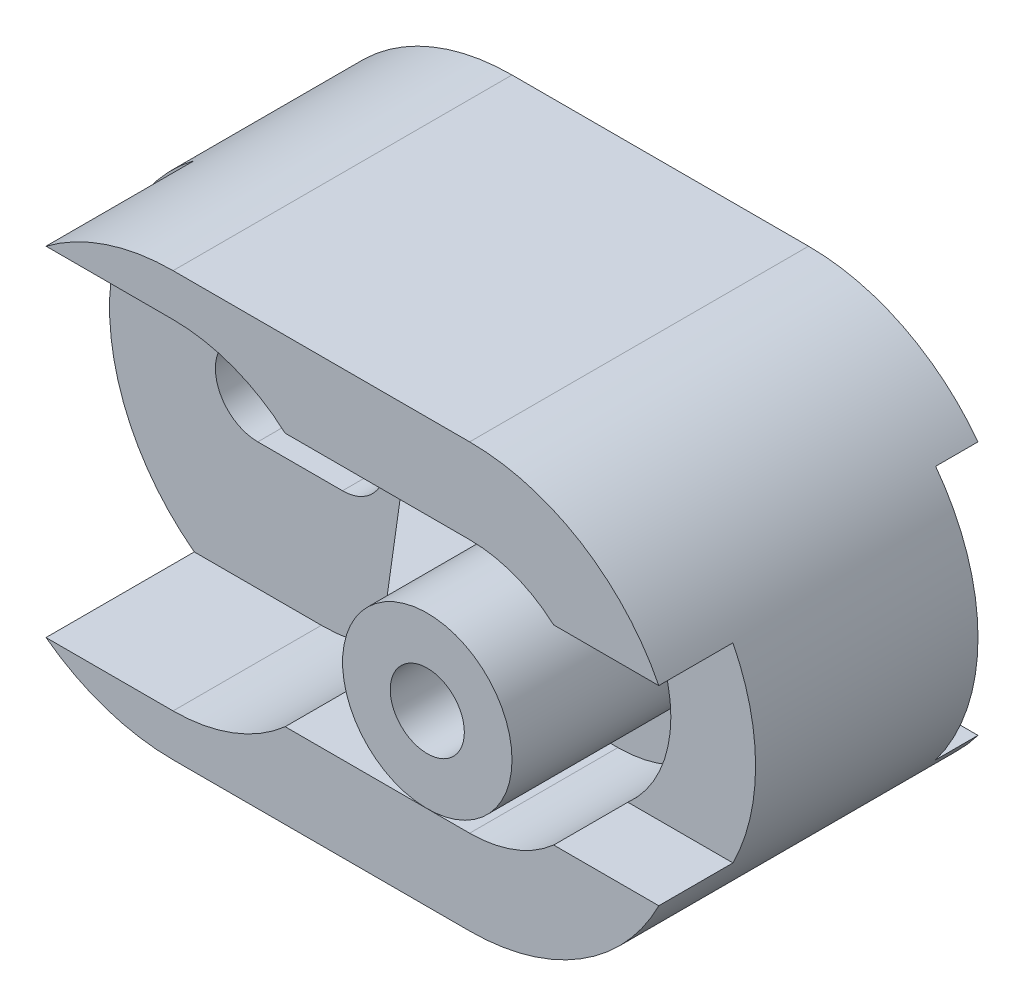
ISO-10303-21;
HEADER;
FILE_DESCRIPTION(('STEP AP214'),'2;1');
FILE_NAME('part.step','',(''),(''),'','','');
FILE_SCHEMA(('AUTOMOTIVE_DESIGN { 1 0 10303 214 1 1 1 1 }'));
ENDSEC;
DATA;
#1=APPLICATION_CONTEXT('core data for automotive mechanical design processes');
#2=APPLICATION_PROTOCOL_DEFINITION('international standard','automotive_design',2000,#1);
#3=PRODUCT_CONTEXT('',#1,'mechanical');
#4=PRODUCT('Part','Part','',(#3));
#5=PRODUCT_RELATED_PRODUCT_CATEGORY('part','',(#4));
#6=PRODUCT_DEFINITION_FORMATION('','',#4);
#7=PRODUCT_DEFINITION_CONTEXT('part definition',#1,'design');
#8=PRODUCT_DEFINITION('design','',#6,#7);
#9=PRODUCT_DEFINITION_SHAPE('','',#8);
#10=(LENGTH_UNIT() NAMED_UNIT(*) SI_UNIT(.MILLI.,.METRE.));
#11=(NAMED_UNIT(*) PLANE_ANGLE_UNIT() SI_UNIT($,.RADIAN.));
#12=(NAMED_UNIT(*) SI_UNIT($,.STERADIAN.) SOLID_ANGLE_UNIT());
#13=UNCERTAINTY_MEASURE_WITH_UNIT(LENGTH_MEASURE(1.E-05),#10,'distance_accuracy_value','');
#14=(GEOMETRIC_REPRESENTATION_CONTEXT(3) GLOBAL_UNCERTAINTY_ASSIGNED_CONTEXT((#13)) GLOBAL_UNIT_ASSIGNED_CONTEXT((#10,
#11,#12)) REPRESENTATION_CONTEXT('',''));
#15=CARTESIAN_POINT('',(0.,0.,0.));
#16=DIRECTION('',(0.,0.,1.));
#17=DIRECTION('',(1.,0.,0.));
#18=AXIS2_PLACEMENT_3D('',#15,#16,#17);
#19=CARTESIAN_POINT('',(1.5,0.5,4.5));
#20=DIRECTION('',(-1.,0.,0.));
#21=DIRECTION('',(0.,0.,1.));
#22=AXIS2_PLACEMENT_3D('',#19,#20,#21);
#23=PLANE('',#22);
#24=DIRECTION('',(0.,0.,-1.));
#25=VECTOR('',#24,1.);
#26=CARTESIAN_POINT('',(1.5,-0.5,4.5));
#27=LINE('',#26,#25);
#28=CARTESIAN_POINT('',(1.5,-0.5,8.));
#29=VERTEX_POINT('',#28);
#30=CARTESIAN_POINT('',(1.5,-0.5,4.5));
#31=VERTEX_POINT('',#30);
#32=EDGE_CURVE('E96',#29,#31,#27,.T.);
#33=ORIENTED_EDGE('',*,*,#32,.T.);
#34=DIRECTION('',(0.,-1.,0.));
#35=VECTOR('',#34,1.);
#36=CARTESIAN_POINT('',(1.5,0.5,4.5));
#37=LINE('',#36,#35);
#38=CARTESIAN_POINT('',(1.5,0.5,4.5));
#39=VERTEX_POINT('',#38);
#40=EDGE_CURVE('E12',#39,#31,#37,.T.);
#41=ORIENTED_EDGE('',*,*,#40,.F.);
#42=DIRECTION('',(0.,0.,-1.));
#43=VECTOR('',#42,1.);
#44=CARTESIAN_POINT('',(1.5,0.5,4.5));
#45=LINE('',#44,#43);
#46=CARTESIAN_POINT('',(1.5,0.5,8.));
#47=VERTEX_POINT('',#46);
#48=EDGE_CURVE('E89',#47,#39,#45,.T.);
#49=ORIENTED_EDGE('',*,*,#48,.F.);
#50=DIRECTION('',(0.,-1.,0.));
#51=VECTOR('',#50,1.);
#52=CARTESIAN_POINT('',(1.5,0.5,8.));
#53=LINE('',#52,#51);
#54=CARTESIAN_POINT('',(1.5,0.,8.));
#55=VERTEX_POINT('',#54);
#56=EDGE_CURVE('E105',#47,#55,#53,.T.);
#57=ORIENTED_EDGE('',*,*,#56,.T.);
#58=EDGE_CURVE('E60',#55,#29,#53,.T.);
#59=ORIENTED_EDGE('',*,*,#58,.T.);
#60=EDGE_LOOP('',(#33,#41,#49,#57,#59));
#61=FACE_BOUND('',#60,.T.);
#62=ADVANCED_FACE('F46',(#61),#23,.F.);
#63=CARTESIAN_POINT('',(-1.5,0.5,4.5));
#64=DIRECTION('',(0.,0.,1.));
#65=DIRECTION('',(1.,0.,0.));
#66=AXIS2_PLACEMENT_3D('',#63,#64,#65);
#67=PLANE('',#66);
#68=DIRECTION('',(-1.,0.,0.));
#69=VECTOR('',#68,1.);
#70=CARTESIAN_POINT('',(-1.5,-0.5,4.5));
#71=LINE('',#70,#69);
#72=CARTESIAN_POINT('',(-1.5,-0.5,4.5));
#73=VERTEX_POINT('',#72);
#74=EDGE_CURVE('E99',#31,#73,#71,.T.);
#75=ORIENTED_EDGE('',*,*,#74,.T.);
#76=DIRECTION('',(0.,-1.,0.));
#77=VECTOR('',#76,1.);
#78=CARTESIAN_POINT('',(-1.5,0.5,4.5));
#79=LINE('',#78,#77);
#80=CARTESIAN_POINT('',(-1.5,0.5,4.5));
#81=VERTEX_POINT('',#80);
#82=EDGE_CURVE('E53',#81,#73,#79,.T.);
#83=ORIENTED_EDGE('',*,*,#82,.F.);
#84=DIRECTION('',(-1.,0.,0.));
#85=VECTOR('',#84,1.);
#86=CARTESIAN_POINT('',(-1.5,0.5,4.5));
#87=LINE('',#86,#85);
#88=EDGE_CURVE('E85',#39,#81,#87,.T.);
#89=ORIENTED_EDGE('',*,*,#88,.F.);
#90=ORIENTED_EDGE('',*,*,#40,.T.);
#91=EDGE_LOOP('',(#75,#83,#89,#90));
#92=FACE_BOUND('',#91,.T.);
#93=ADVANCED_FACE('F86',(#92),#67,.F.);
#94=CARTESIAN_POINT('',(1.5,0.5,8.));
#95=DIRECTION('',(0.759256602365297,0.,-0.650791373455969));
#96=DIRECTION('',(-0.650791373455969,0.,-0.759256602365297));
#97=AXIS2_PLACEMENT_3D('',#94,#95,#96);
#98=PLANE('',#97);
#99=DIRECTION('',(0.650791373455969,0.,0.759256602365297));
#100=VECTOR('',#99,1.);
#101=CARTESIAN_POINT('',(1.5,-0.5,8.));
#102=LINE('',#101,#100);
#103=EDGE_CURVE('E93',#73,#29,#102,.T.);
#104=ORIENTED_EDGE('',*,*,#103,.T.);
#105=ORIENTED_EDGE('',*,*,#58,.F.);
#106=ORIENTED_EDGE('',*,*,#56,.F.);
#107=DIRECTION('',(0.650791373455969,0.,0.759256602365297));
#108=VECTOR('',#107,1.);
#109=CARTESIAN_POINT('',(1.5,0.5,8.));
#110=LINE('',#109,#108);
#111=EDGE_CURVE('E69',#81,#47,#110,.T.);
#112=ORIENTED_EDGE('',*,*,#111,.F.);
#113=ORIENTED_EDGE('',*,*,#82,.T.);
#114=EDGE_LOOP('',(#104,#105,#106,#112,#113));
#115=FACE_BOUND('',#114,.T.);
#116=ADVANCED_FACE('F106',(#115),#98,.F.);
#117=CARTESIAN_POINT('',(0.,0.5,0.));
#118=DIRECTION('',(0.,1.,0.));
#119=DIRECTION('',(0.,0.,1.));
#120=AXIS2_PLACEMENT_3D('',#117,#118,#119);
#121=PLANE('',#120);
#122=ORIENTED_EDGE('',*,*,#48,.T.);
#123=ORIENTED_EDGE('',*,*,#88,.T.);
#124=ORIENTED_EDGE('',*,*,#111,.T.);
#125=EDGE_LOOP('',(#122,#123,#124));
#126=FACE_BOUND('',#125,.T.);
#127=ADVANCED_FACE('F92',(#126),#121,.T.);
#128=CARTESIAN_POINT('',(0.,-0.5,0.));
#129=DIRECTION('',(0.,1.,0.));
#130=DIRECTION('',(0.,0.,1.));
#131=AXIS2_PLACEMENT_3D('',#128,#129,#130);
#132=PLANE('',#131);
#133=ORIENTED_EDGE('',*,*,#32,.F.);
#134=ORIENTED_EDGE('',*,*,#103,.F.);
#135=ORIENTED_EDGE('',*,*,#74,.F.);
#136=EDGE_LOOP('',(#133,#134,#135));
#137=FACE_BOUND('',#136,.T.);
#138=ADVANCED_FACE('F107',(#137),#132,.F.);
#139=CLOSED_SHELL('',(#62,#93,#116,#127,#138));
#140=MANIFOLD_SOLID_BREP('B2',#139);
#141=CARTESIAN_POINT('',(3.5,0.,8.));
#142=DIRECTION('',(0.,0.,-1.));
#143=DIRECTION('',(-1.,0.,0.));
#144=AXIS2_PLACEMENT_3D('',#141,#142,#143);
#145=CYLINDRICAL_SURFACE('',#144,5.);
#146=DIRECTION('',(0.,0.,1.));
#147=VECTOR('',#146,1.);
#148=CARTESIAN_POINT('',(7.96514277487294,2.25,6.25));
#149=LINE('',#148,#147);
#150=CARTESIAN_POINT('',(7.96514277487294,2.25,6.25));
#151=VERTEX_POINT('',#150);
#152=CARTESIAN_POINT('',(7.96514277487294,2.25,8.));
#153=VERTEX_POINT('',#152);
#154=EDGE_CURVE('E367',#151,#153,#149,.T.);
#155=ORIENTED_EDGE('',*,*,#154,.F.);
#156=CARTESIAN_POINT('',(3.5,0.,6.25));
#157=DIRECTION('',(0.,0.,1.));
#158=DIRECTION('',(1.,0.,0.));
#159=AXIS2_PLACEMENT_3D('',#156,#157,#158);
#160=CIRCLE('',#159,5.);
#161=CARTESIAN_POINT('',(7.96514277487294,-2.25,6.25));
#162=VERTEX_POINT('',#161);
#163=EDGE_CURVE('E357',#162,#151,#160,.T.);
#164=ORIENTED_EDGE('',*,*,#163,.F.);
#165=DIRECTION('',(0.,0.,1.));
#166=VECTOR('',#165,1.);
#167=CARTESIAN_POINT('',(7.96514277487294,-2.25,6.25));
#168=LINE('',#167,#166);
#169=CARTESIAN_POINT('',(7.96514277487294,-2.25,8.));
#170=VERTEX_POINT('',#169);
#171=EDGE_CURVE('E369',#162,#170,#168,.T.);
#172=ORIENTED_EDGE('',*,*,#171,.T.);
#173=CARTESIAN_POINT('',(3.5,0.,8.));
#174=DIRECTION('',(0.,0.,1.));
#175=DIRECTION('',(1.,0.,0.));
#176=AXIS2_PLACEMENT_3D('',#173,#174,#175);
#177=CIRCLE('',#176,5.);
#178=CARTESIAN_POINT('',(3.5,-5.,8.));
#179=VERTEX_POINT('',#178);
#180=EDGE_CURVE('E497',#179,#170,#177,.T.);
#181=ORIENTED_EDGE('',*,*,#180,.F.);
#182=DIRECTION('',(0.,0.,-1.));
#183=VECTOR('',#182,1.);
#184=CARTESIAN_POINT('',(3.5,-5.,8.));
#185=LINE('',#184,#183);
#186=CARTESIAN_POINT('',(3.5,-5.,0.));
#187=VERTEX_POINT('',#186);
#188=EDGE_CURVE('E519',#179,#187,#185,.T.);
#189=ORIENTED_EDGE('',*,*,#188,.T.);
#190=CARTESIAN_POINT('',(3.5,0.,0.));
#191=DIRECTION('',(0.,0.,1.));
#192=DIRECTION('',(1.,0.,0.));
#193=AXIS2_PLACEMENT_3D('',#190,#191,#192);
#194=CIRCLE('',#193,5.);
#195=CARTESIAN_POINT('',(7.5,-3.,0.));
#196=VERTEX_POINT('',#195);
#197=EDGE_CURVE('E509',#187,#196,#194,.T.);
#198=ORIENTED_EDGE('',*,*,#197,.T.);
#199=DIRECTION('',(0.,0.,-1.));
#200=VECTOR('',#199,1.);
#201=CARTESIAN_POINT('',(7.5,-3.,8.));
#202=LINE('',#201,#200);
#203=CARTESIAN_POINT('',(7.5,-3.,1.));
#204=VERTEX_POINT('',#203);
#205=EDGE_CURVE('E479',#196,#204,#202,.F.);
#206=ORIENTED_EDGE('',*,*,#205,.T.);
#207=CARTESIAN_POINT('',(3.5,0.,1.));
#208=DIRECTION('',(0.,0.,1.));
#209=DIRECTION('',(0.,-1.,0.));
#210=AXIS2_PLACEMENT_3D('',#207,#208,#209);
#211=CIRCLE('',#210,5.);
#212=CARTESIAN_POINT('',(7.50000000000001,3.,1.));
#213=VERTEX_POINT('',#212);
#214=EDGE_CURVE('E531',#204,#213,#211,.T.);
#215=ORIENTED_EDGE('',*,*,#214,.T.);
#216=DIRECTION('',(0.,0.,-1.));
#217=VECTOR('',#216,1.);
#218=CARTESIAN_POINT('',(7.50000000000001,3.,8.));
#219=LINE('',#218,#217);
#220=CARTESIAN_POINT('',(7.5,3.,0.));
#221=VERTEX_POINT('',#220);
#222=EDGE_CURVE('E471',#213,#221,#219,.T.);
#223=ORIENTED_EDGE('',*,*,#222,.T.);
#224=CARTESIAN_POINT('',(3.5,5.,0.));
#225=VERTEX_POINT('',#224);
#226=EDGE_CURVE('E508',#221,#225,#194,.T.);
#227=ORIENTED_EDGE('',*,*,#226,.T.);
#228=DIRECTION('',(0.,0.,-1.));
#229=VECTOR('',#228,1.);
#230=CARTESIAN_POINT('',(3.5,5.,8.));
#231=LINE('',#230,#229);
#232=CARTESIAN_POINT('',(3.5,5.,8.));
#233=VERTEX_POINT('',#232);
#234=EDGE_CURVE('E516',#233,#225,#231,.T.);
#235=ORIENTED_EDGE('',*,*,#234,.F.);
#236=EDGE_CURVE('E496',#153,#233,#177,.T.);
#237=ORIENTED_EDGE('',*,*,#236,.F.);
#238=EDGE_LOOP('',(#155,#164,#172,#181,#189,#198,#206,#215,#223,#227,#235,#237));
#239=FACE_BOUND('',#238,.T.);
#240=ADVANCED_FACE('F145',(#239),#145,.T.);
#241=CARTESIAN_POINT('',(-3.5,0.,8.));
#242=DIRECTION('',(0.,0.,1.));
#243=DIRECTION('',(1.,0.,0.));
#244=AXIS2_PLACEMENT_3D('',#241,#242,#243);
#245=PLANE('',#244);
#246=CARTESIAN_POINT('',(3.5,0.,8.));
#247=DIRECTION('',(0.,0.,1.));
#248=DIRECTION('',(1.,0.,0.));
#249=AXIS2_PLACEMENT_3D('',#246,#247,#248);
#250=CIRCLE('',#249,3.);
#251=CARTESIAN_POINT('',(5.48431348329844,2.25,8.));
#252=VERTEX_POINT('',#251);
#253=CARTESIAN_POINT('',(3.5,3.,8.));
#254=VERTEX_POINT('',#253);
#255=EDGE_CURVE('E417',#252,#254,#250,.T.);
#256=ORIENTED_EDGE('',*,*,#255,.F.);
#257=DIRECTION('',(1.,0.,0.));
#258=VECTOR('',#257,1.);
#259=CARTESIAN_POINT('',(0.,2.25,8.));
#260=LINE('',#259,#258);
#261=EDGE_CURVE('E354',#252,#153,#260,.T.);
#262=ORIENTED_EDGE('',*,*,#261,.T.);
#263=ORIENTED_EDGE('',*,*,#236,.T.);
#264=DIRECTION('',(-1.,0.,0.));
#265=VECTOR('',#264,1.);
#266=CARTESIAN_POINT('',(-3.5,5.,8.));
#267=LINE('',#266,#265);
#268=CARTESIAN_POINT('',(-3.5,5.,8.));
#269=VERTEX_POINT('',#268);
#270=EDGE_CURVE('E500',#233,#269,#267,.T.);
#271=ORIENTED_EDGE('',*,*,#270,.T.);
#272=CARTESIAN_POINT('',(-3.5,0.,8.));
#273=DIRECTION('',(0.,0.,1.));
#274=DIRECTION('',(1.,0.,0.));
#275=AXIS2_PLACEMENT_3D('',#272,#273,#274);
#276=CIRCLE('',#275,5.);
#277=CARTESIAN_POINT('',(-6.5,4.,8.));
#278=VERTEX_POINT('',#277);
#279=EDGE_CURVE('E490',#269,#278,#276,.T.);
#280=ORIENTED_EDGE('',*,*,#279,.T.);
#281=DIRECTION('',(1.,0.,0.));
#282=VECTOR('',#281,1.);
#283=CARTESIAN_POINT('',(-3.5,4.,8.));
#284=LINE('',#283,#282);
#285=CARTESIAN_POINT('',(-3.5,4.,8.));
#286=VERTEX_POINT('',#285);
#287=EDGE_CURVE('E539',#278,#286,#284,.T.);
#288=ORIENTED_EDGE('',*,*,#287,.T.);
#289=CARTESIAN_POINT('',(-3.5,0.,8.));
#290=DIRECTION('',(0.,0.,1.));
#291=DIRECTION('',(1.,0.,0.));
#292=AXIS2_PLACEMENT_3D('',#289,#290,#291);
#293=CIRCLE('',#292,4.);
#294=CARTESIAN_POINT('',(-0.85424868893541,3.,8.));
#295=VERTEX_POINT('',#294);
#296=EDGE_CURVE('E396',#295,#286,#293,.T.);
#297=ORIENTED_EDGE('',*,*,#296,.F.);
#298=DIRECTION('',(1.,0.,0.));
#299=VECTOR('',#298,1.);
#300=CARTESIAN_POINT('',(0.,3.,8.));
#301=LINE('',#300,#299);
#302=EDGE_CURVE('E421',#295,#254,#301,.T.);
#303=ORIENTED_EDGE('',*,*,#302,.T.);
#304=EDGE_LOOP('',(#256,#262,#263,#271,#280,#288,#297,#303));
#305=FACE_BOUND('',#304,.T.);
#306=ADVANCED_FACE('F606',(#305),#245,.T.);
#307=CARTESIAN_POINT('',(3.5,0.,4.5));
#308=DIRECTION('',(0.,0.,1.));
#309=DIRECTION('',(1.,0.,0.));
#310=AXIS2_PLACEMENT_3D('',#307,#308,#309);
#311=CYLINDRICAL_SURFACE('',#310,3.);
#312=DIRECTION('',(0.,0.,1.));
#313=VECTOR('',#312,1.);
#314=CARTESIAN_POINT('',(5.48431348329844,2.25,6.25));
#315=LINE('',#314,#313);
#316=CARTESIAN_POINT('',(5.48431348329844,2.25,6.25));
#317=VERTEX_POINT('',#316);
#318=EDGE_CURVE('E364',#317,#252,#315,.T.);
#319=ORIENTED_EDGE('',*,*,#318,.T.);
#320=ORIENTED_EDGE('',*,*,#255,.T.);
#321=DIRECTION('',(0.,0.,1.));
#322=VECTOR('',#321,1.);
#323=CARTESIAN_POINT('',(3.5,3.,4.5));
#324=LINE('',#323,#322);
#325=CARTESIAN_POINT('',(3.5,3.,4.5));
#326=VERTEX_POINT('',#325);
#327=EDGE_CURVE('E432',#326,#254,#324,.T.);
#328=ORIENTED_EDGE('',*,*,#327,.F.);
#329=CARTESIAN_POINT('',(3.5,0.,4.5));
#330=DIRECTION('',(0.,0.,1.));
#331=DIRECTION('',(1.,0.,0.));
#332=AXIS2_PLACEMENT_3D('',#329,#330,#331);
#333=CIRCLE('',#332,3.);
#334=CARTESIAN_POINT('',(3.5,-3.,4.5));
#335=VERTEX_POINT('',#334);
#336=EDGE_CURVE('E400',#335,#326,#333,.T.);
#337=ORIENTED_EDGE('',*,*,#336,.F.);
#338=DIRECTION('',(0.,0.,1.));
#339=VECTOR('',#338,1.);
#340=CARTESIAN_POINT('',(3.5,-3.,4.5));
#341=LINE('',#340,#339);
#342=CARTESIAN_POINT('',(3.5,-3.,8.));
#343=VERTEX_POINT('',#342);
#344=EDGE_CURVE('E435',#335,#343,#341,.T.);
#345=ORIENTED_EDGE('',*,*,#344,.T.);
#346=CARTESIAN_POINT('',(5.48431348329845,-2.25,8.));
#347=VERTEX_POINT('',#346);
#348=EDGE_CURVE('E418',#343,#347,#250,.T.);
#349=ORIENTED_EDGE('',*,*,#348,.T.);
#350=DIRECTION('',(0.,0.,1.));
#351=VECTOR('',#350,1.);
#352=CARTESIAN_POINT('',(5.48431348329845,-2.25,6.25));
#353=LINE('',#352,#351);
#354=CARTESIAN_POINT('',(5.48431348329845,-2.25,6.25));
#355=VERTEX_POINT('',#354);
#356=EDGE_CURVE('E360',#355,#347,#353,.T.);
#357=ORIENTED_EDGE('',*,*,#356,.F.);
#358=CARTESIAN_POINT('',(3.5,0.,6.25));
#359=DIRECTION('',(0.,0.,1.));
#360=DIRECTION('',(1.,0.,0.));
#361=AXIS2_PLACEMENT_3D('',#358,#359,#360);
#362=CIRCLE('',#361,3.);
#363=EDGE_CURVE('E351',#317,#355,#362,.F.);
#364=ORIENTED_EDGE('',*,*,#363,.F.);
#365=EDGE_LOOP('',(#319,#320,#328,#337,#345,#349,#357,#364));
#366=FACE_BOUND('',#365,.T.);
#367=ADVANCED_FACE('F658',(#366),#311,.F.);
#368=CARTESIAN_POINT('',(-3.5,0.,0.));
#369=DIRECTION('',(0.,0.,1.));
#370=DIRECTION('',(1.,0.,0.));
#371=AXIS2_PLACEMENT_3D('',#368,#369,#370);
#372=PLANE('',#371);
#373=CARTESIAN_POINT('',(-3.5,0.,0.));
#374=DIRECTION('',(0.,0.,1.));
#375=DIRECTION('',(1.,0.,0.));
#376=AXIS2_PLACEMENT_3D('',#373,#374,#375);
#377=CIRCLE('',#376,5.);
#378=CARTESIAN_POINT('',(-7.5,-3.,0.));
#379=VERTEX_POINT('',#378);
#380=CARTESIAN_POINT('',(-3.5,-5.,0.));
#381=VERTEX_POINT('',#380);
#382=EDGE_CURVE('E489',#379,#381,#377,.T.);
#383=ORIENTED_EDGE('',*,*,#382,.F.);
#384=DIRECTION('',(1.,0.,0.));
#385=VECTOR('',#384,1.);
#386=CARTESIAN_POINT('',(-3.5,-3.,0.));
#387=LINE('',#386,#385);
#388=EDGE_CURVE('E528',#379,#196,#387,.T.);
#389=ORIENTED_EDGE('',*,*,#388,.T.);
#390=ORIENTED_EDGE('',*,*,#197,.F.);
#391=DIRECTION('',(1.,0.,0.));
#392=VECTOR('',#391,1.);
#393=CARTESIAN_POINT('',(-3.5,-5.,0.));
#394=LINE('',#393,#392);
#395=EDGE_CURVE('E506',#381,#187,#394,.T.);
#396=ORIENTED_EDGE('',*,*,#395,.F.);
#397=EDGE_LOOP('',(#383,#389,#390,#396));
#398=FACE_BOUND('',#397,.T.);
#399=ADVANCED_FACE('F632',(#398),#372,.F.);
#400=CARTESIAN_POINT('',(-3.5,0.,8.));
#401=DIRECTION('',(0.,0.,-1.));
#402=DIRECTION('',(-1.,0.,0.));
#403=AXIS2_PLACEMENT_3D('',#400,#401,#402);
#404=CYLINDRICAL_SURFACE('',#403,5.);
#405=CARTESIAN_POINT('',(-6.5,-4.,8.));
#406=VERTEX_POINT('',#405);
#407=CARTESIAN_POINT('',(-3.5,-5.,8.));
#408=VERTEX_POINT('',#407);
#409=EDGE_CURVE('E494',#406,#408,#276,.T.);
#410=ORIENTED_EDGE('',*,*,#409,.F.);
#411=DIRECTION('',(0.,0.,-1.));
#412=VECTOR('',#411,1.);
#413=CARTESIAN_POINT('',(-6.5,-4.,8.));
#414=LINE('',#413,#412);
#415=CARTESIAN_POINT('',(-6.5,-4.,4.5));
#416=VERTEX_POINT('',#415);
#417=EDGE_CURVE('E440',#406,#416,#414,.T.);
#418=ORIENTED_EDGE('',*,*,#417,.T.);
#419=CARTESIAN_POINT('',(-3.5,0.,4.5));
#420=DIRECTION('',(0.,0.,1.));
#421=DIRECTION('',(1.,0.,0.));
#422=AXIS2_PLACEMENT_3D('',#419,#420,#421);
#423=CIRCLE('',#422,5.);
#424=CARTESIAN_POINT('',(-6.5,4.,4.5));
#425=VERTEX_POINT('',#424);
#426=EDGE_CURVE('E544',#425,#416,#423,.T.);
#427=ORIENTED_EDGE('',*,*,#426,.F.);
#428=DIRECTION('',(0.,0.,-1.));
#429=VECTOR('',#428,1.);
#430=CARTESIAN_POINT('',(-6.5,4.,8.));
#431=LINE('',#430,#429);
#432=EDGE_CURVE('E427',#278,#425,#431,.T.);
#433=ORIENTED_EDGE('',*,*,#432,.F.);
#434=ORIENTED_EDGE('',*,*,#279,.F.);
#435=DIRECTION('',(0.,0.,-1.));
#436=VECTOR('',#435,1.);
#437=CARTESIAN_POINT('',(-3.5,5.,8.));
#438=LINE('',#437,#436);
#439=CARTESIAN_POINT('',(-3.5,5.,0.));
#440=VERTEX_POINT('',#439);
#441=EDGE_CURVE('E502',#269,#440,#438,.T.);
#442=ORIENTED_EDGE('',*,*,#441,.T.);
#443=CARTESIAN_POINT('',(-7.5,3.,0.));
#444=VERTEX_POINT('',#443);
#445=EDGE_CURVE('E503',#440,#444,#377,.T.);
#446=ORIENTED_EDGE('',*,*,#445,.T.);
#447=DIRECTION('',(0.,0.,-1.));
#448=VECTOR('',#447,1.);
#449=CARTESIAN_POINT('',(-7.5,3.,8.));
#450=LINE('',#449,#448);
#451=CARTESIAN_POINT('',(-7.5,3.,1.));
#452=VERTEX_POINT('',#451);
#453=EDGE_CURVE('E476',#444,#452,#450,.F.);
#454=ORIENTED_EDGE('',*,*,#453,.T.);
#455=CARTESIAN_POINT('',(-3.5,0.,1.));
#456=DIRECTION('',(0.,0.,1.));
#457=DIRECTION('',(0.,-1.,0.));
#458=AXIS2_PLACEMENT_3D('',#455,#456,#457);
#459=CIRCLE('',#458,5.);
#460=CARTESIAN_POINT('',(-8.08257569495584,2.,1.));
#461=VERTEX_POINT('',#460);
#462=EDGE_CURVE('E486',#452,#461,#459,.T.);
#463=ORIENTED_EDGE('',*,*,#462,.T.);
#464=DIRECTION('',(0.,0.,-1.));
#465=VECTOR('',#464,1.);
#466=CARTESIAN_POINT('',(-8.08257569495584,2.,8.));
#467=LINE('',#466,#465);
#468=CARTESIAN_POINT('',(-8.08257569495584,2.,2.));
#469=VERTEX_POINT('',#468);
#470=EDGE_CURVE('E464',#461,#469,#467,.F.);
#471=ORIENTED_EDGE('',*,*,#470,.T.);
#472=CARTESIAN_POINT('',(-3.5,0.,2.));
#473=DIRECTION('',(0.,0.,-1.));
#474=DIRECTION('',(0.,1.,0.));
#475=AXIS2_PLACEMENT_3D('',#472,#473,#474);
#476=CIRCLE('',#475,5.);
#477=CARTESIAN_POINT('',(-8.08257569495584,-2.,2.));
#478=VERTEX_POINT('',#477);
#479=EDGE_CURVE('E537',#478,#469,#476,.T.);
#480=ORIENTED_EDGE('',*,*,#479,.F.);
#481=DIRECTION('',(0.,0.,-1.));
#482=VECTOR('',#481,1.);
#483=CARTESIAN_POINT('',(-8.08257569495584,-2.,8.));
#484=LINE('',#483,#482);
#485=CARTESIAN_POINT('',(-8.08257569495584,-2.,1.));
#486=VERTEX_POINT('',#485);
#487=EDGE_CURVE('E459',#478,#486,#484,.T.);
#488=ORIENTED_EDGE('',*,*,#487,.T.);
#489=CARTESIAN_POINT('',(-7.5,-3.,1.));
#490=VERTEX_POINT('',#489);
#491=EDGE_CURVE('E485',#486,#490,#459,.T.);
#492=ORIENTED_EDGE('',*,*,#491,.T.);
#493=DIRECTION('',(0.,0.,-1.));
#494=VECTOR('',#493,1.);
#495=CARTESIAN_POINT('',(-7.5,-3.,8.));
#496=LINE('',#495,#494);
#497=EDGE_CURVE('E482',#490,#379,#496,.T.);
#498=ORIENTED_EDGE('',*,*,#497,.T.);
#499=ORIENTED_EDGE('',*,*,#382,.T.);
#500=DIRECTION('',(0.,0.,-1.));
#501=VECTOR('',#500,1.);
#502=CARTESIAN_POINT('',(-3.5,-5.,8.));
#503=LINE('',#502,#501);
#504=EDGE_CURVE('E522',#408,#381,#503,.T.);
#505=ORIENTED_EDGE('',*,*,#504,.F.);
#506=EDGE_LOOP('',(#410,#418,#427,#433,#434,#442,#446,#454,#463,#471,#480,#488,#492,#498,#499,#505));
#507=FACE_BOUND('',#506,.T.);
#508=ADVANCED_FACE('F147',(#507),#404,.T.);
#509=CARTESIAN_POINT('',(-3.5,-5.,8.));
#510=DIRECTION('',(0.,1.,0.));
#511=DIRECTION('',(-1.,0.,0.));
#512=AXIS2_PLACEMENT_3D('',#509,#510,#511);
#513=PLANE('',#512);
#514=ORIENTED_EDGE('',*,*,#395,.T.);
#515=ORIENTED_EDGE('',*,*,#188,.F.);
#516=DIRECTION('',(1.,0.,0.));
#517=VECTOR('',#516,1.);
#518=CARTESIAN_POINT('',(-3.5,-5.,8.));
#519=LINE('',#518,#517);
#520=EDGE_CURVE('E493',#408,#179,#519,.T.);
#521=ORIENTED_EDGE('',*,*,#520,.F.);
#522=ORIENTED_EDGE('',*,*,#504,.T.);
#523=EDGE_LOOP('',(#514,#515,#521,#522));
#524=FACE_BOUND('',#523,.T.);
#525=ADVANCED_FACE('F627',(#524),#513,.F.);
#526=CARTESIAN_POINT('',(-3.5,5.,8.));
#527=DIRECTION('',(0.,-1.,0.));
#528=DIRECTION('',(1.,0.,0.));
#529=AXIS2_PLACEMENT_3D('',#526,#527,#528);
#530=PLANE('',#529);
#531=DIRECTION('',(-1.,0.,0.));
#532=VECTOR('',#531,1.);
#533=CARTESIAN_POINT('',(-3.5,5.,0.));
#534=LINE('',#533,#532);
#535=EDGE_CURVE('E512',#225,#440,#534,.T.);
#536=ORIENTED_EDGE('',*,*,#535,.T.);
#537=ORIENTED_EDGE('',*,*,#441,.F.);
#538=ORIENTED_EDGE('',*,*,#270,.F.);
#539=ORIENTED_EDGE('',*,*,#234,.T.);
#540=EDGE_LOOP('',(#536,#537,#538,#539));
#541=FACE_BOUND('',#540,.T.);
#542=ADVANCED_FACE('F599',(#541),#530,.F.);
#543=DIRECTION('',(1.,0.,0.));
#544=VECTOR('',#543,1.);
#545=CARTESIAN_POINT('',(0.,-2.25,8.));
#546=LINE('',#545,#544);
#547=EDGE_CURVE('E346',#347,#170,#546,.T.);
#548=ORIENTED_EDGE('',*,*,#547,.F.);
#549=ORIENTED_EDGE('',*,*,#348,.F.);
#550=DIRECTION('',(1.,0.,0.));
#551=VECTOR('',#550,1.);
#552=CARTESIAN_POINT('',(0.,-3.,8.));
#553=LINE('',#552,#551);
#554=CARTESIAN_POINT('',(-0.85424868893541,-3.,8.));
#555=VERTEX_POINT('',#554);
#556=EDGE_CURVE('E414',#555,#343,#553,.T.);
#557=ORIENTED_EDGE('',*,*,#556,.F.);
#558=CARTESIAN_POINT('',(-3.5,-4.,8.));
#559=VERTEX_POINT('',#558);
#560=EDGE_CURVE('E386',#559,#555,#293,.T.);
#561=ORIENTED_EDGE('',*,*,#560,.F.);
#562=DIRECTION('',(1.,0.,0.));
#563=VECTOR('',#562,1.);
#564=CARTESIAN_POINT('',(-3.5,-4.,8.));
#565=LINE('',#564,#563);
#566=EDGE_CURVE('E542',#406,#559,#565,.T.);
#567=ORIENTED_EDGE('',*,*,#566,.F.);
#568=ORIENTED_EDGE('',*,*,#409,.T.);
#569=ORIENTED_EDGE('',*,*,#520,.T.);
#570=ORIENTED_EDGE('',*,*,#180,.T.);
#571=EDGE_LOOP('',(#548,#549,#557,#561,#567,#568,#569,#570));
#572=FACE_BOUND('',#571,.T.);
#573=ADVANCED_FACE('F620',(#572),#245,.T.);
#574=ORIENTED_EDGE('',*,*,#226,.F.);
#575=DIRECTION('',(-1.,0.,0.));
#576=VECTOR('',#575,1.);
#577=CARTESIAN_POINT('',(-3.5,3.,0.));
#578=LINE('',#577,#576);
#579=EDGE_CURVE('E525',#221,#444,#578,.T.);
#580=ORIENTED_EDGE('',*,*,#579,.T.);
#581=ORIENTED_EDGE('',*,*,#445,.F.);
#582=ORIENTED_EDGE('',*,*,#535,.F.);
#583=EDGE_LOOP('',(#574,#580,#581,#582));
#584=FACE_BOUND('',#583,.T.);
#585=ADVANCED_FACE('F595',(#584),#372,.F.);
#586=CARTESIAN_POINT('',(-9.,3.,1.));
#587=DIRECTION('',(0.,0.,1.));
#588=DIRECTION('',(0.,-1.,0.));
#589=AXIS2_PLACEMENT_3D('',#586,#587,#588);
#590=PLANE('',#589);
#591=CARTESIAN_POINT('',(-3.00090403532033,0.,1.));
#592=DIRECTION('',(0.,0.,-1.));
#593=DIRECTION('',(0.,1.,0.));
#594=AXIS2_PLACEMENT_3D('',#591,#592,#593);
#595=CIRCLE('',#594,2.);
#596=CARTESIAN_POINT('',(-3.00090403532033,2.,1.));
#597=VERTEX_POINT('',#596);
#598=CARTESIAN_POINT('',(-3.00090403532033,-2.,1.));
#599=VERTEX_POINT('',#598);
#600=EDGE_CURVE('E443',#597,#599,#595,.T.);
#601=ORIENTED_EDGE('',*,*,#600,.F.);
#602=DIRECTION('',(-1.,0.,0.));
#603=VECTOR('',#602,1.);
#604=CARTESIAN_POINT('',(-9.,2.,1.));
#605=LINE('',#604,#603);
#606=EDGE_CURVE('E534',#597,#461,#605,.T.);
#607=ORIENTED_EDGE('',*,*,#606,.T.);
#608=ORIENTED_EDGE('',*,*,#462,.F.);
#609=DIRECTION('',(1.,0.,0.));
#610=VECTOR('',#609,1.);
#611=CARTESIAN_POINT('',(-9.,3.,1.));
#612=LINE('',#611,#610);
#613=EDGE_CURVE('E467',#452,#213,#612,.T.);
#614=ORIENTED_EDGE('',*,*,#613,.T.);
#615=ORIENTED_EDGE('',*,*,#214,.F.);
#616=DIRECTION('',(1.,0.,0.));
#617=VECTOR('',#616,1.);
#618=CARTESIAN_POINT('',(-9.,-3.,0.999999999999999));
#619=LINE('',#618,#617);
#620=EDGE_CURVE('E468',#490,#204,#619,.T.);
#621=ORIENTED_EDGE('',*,*,#620,.F.);
#622=ORIENTED_EDGE('',*,*,#491,.F.);
#623=DIRECTION('',(-1.,0.,0.));
#624=VECTOR('',#623,1.);
#625=CARTESIAN_POINT('',(-3.00090403532033,-2.,1.));
#626=LINE('',#625,#624);
#627=EDGE_CURVE('E448',#599,#486,#626,.T.);
#628=ORIENTED_EDGE('',*,*,#627,.F.);
#629=EDGE_LOOP('',(#601,#607,#608,#614,#615,#621,#622,#628));
#630=FACE_BOUND('',#629,.T.);
#631=ADVANCED_FACE('F587',(#630),#590,.F.);
#632=CARTESIAN_POINT('',(-9.,-3.,0.));
#633=DIRECTION('',(0.,-1.,0.));
#634=DIRECTION('',(0.,0.,-1.));
#635=AXIS2_PLACEMENT_3D('',#632,#633,#634);
#636=PLANE('',#635);
#637=ORIENTED_EDGE('',*,*,#620,.T.);
#638=ORIENTED_EDGE('',*,*,#205,.F.);
#639=ORIENTED_EDGE('',*,*,#388,.F.);
#640=ORIENTED_EDGE('',*,*,#497,.F.);
#641=EDGE_LOOP('',(#637,#638,#639,#640));
#642=FACE_BOUND('',#641,.T.);
#643=ADVANCED_FACE('F635',(#642),#636,.F.);
#644=CARTESIAN_POINT('',(-9.,3.,0.));
#645=DIRECTION('',(0.,1.,0.));
#646=DIRECTION('',(0.,0.,1.));
#647=AXIS2_PLACEMENT_3D('',#644,#645,#646);
#648=PLANE('',#647);
#649=ORIENTED_EDGE('',*,*,#579,.F.);
#650=ORIENTED_EDGE('',*,*,#222,.F.);
#651=ORIENTED_EDGE('',*,*,#613,.F.);
#652=ORIENTED_EDGE('',*,*,#453,.F.);
#653=EDGE_LOOP('',(#649,#650,#651,#652));
#654=FACE_BOUND('',#653,.T.);
#655=ADVANCED_FACE('F574',(#654),#648,.F.);
#656=CARTESIAN_POINT('',(-3.00090403532033,0.,2.));
#657=DIRECTION('',(0.,0.,-1.));
#658=DIRECTION('',(0.,1.,0.));
#659=AXIS2_PLACEMENT_3D('',#656,#657,#658);
#660=PLANE('',#659);
#661=CARTESIAN_POINT('',(-3.00090403532033,0.,2.));
#662=DIRECTION('',(0.,0.,-1.));
#663=DIRECTION('',(0.,1.,0.));
#664=AXIS2_PLACEMENT_3D('',#661,#662,#663);
#665=CIRCLE('',#664,1.);
#666=CARTESIAN_POINT('',(-3.00090403532033,1.,2.));
#667=VERTEX_POINT('',#666);
#668=CARTESIAN_POINT('',(-3.00090403532033,-1.,2.));
#669=VERTEX_POINT('',#668);
#670=EDGE_CURVE('E168',#667,#669,#665,.T.);
#671=ORIENTED_EDGE('',*,*,#670,.F.);
#672=DIRECTION('',(1.,0.,0.));
#673=VECTOR('',#672,1.);
#674=CARTESIAN_POINT('',(-3.00090403532033,1.,2.));
#675=LINE('',#674,#673);
#676=CARTESIAN_POINT('',(-5.00090403532033,1.,2.));
#677=VERTEX_POINT('',#676);
#678=EDGE_CURVE('E380',#677,#667,#675,.T.);
#679=ORIENTED_EDGE('',*,*,#678,.F.);
#680=CARTESIAN_POINT('',(-5.00090403532033,0.,2.));
#681=DIRECTION('',(0.,0.,-1.));
#682=DIRECTION('',(0.,1.,0.));
#683=AXIS2_PLACEMENT_3D('',#680,#681,#682);
#684=CIRCLE('',#683,1.);
#685=CARTESIAN_POINT('',(-5.00090403532033,-1.,2.));
#686=VERTEX_POINT('',#685);
#687=EDGE_CURVE('E377',#686,#677,#684,.T.);
#688=ORIENTED_EDGE('',*,*,#687,.F.);
#689=DIRECTION('',(-1.,0.,0.));
#690=VECTOR('',#689,1.);
#691=CARTESIAN_POINT('',(-3.00090403532033,-1.,2.));
#692=LINE('',#691,#690);
#693=EDGE_CURVE('E374',#669,#686,#692,.T.);
#694=ORIENTED_EDGE('',*,*,#693,.F.);
#695=EDGE_LOOP('',(#671,#679,#688,#694));
#696=FACE_BOUND('',#695,.T.);
#697=ORIENTED_EDGE('',*,*,#479,.T.);
#698=DIRECTION('',(1.,0.,0.));
#699=VECTOR('',#698,1.);
#700=CARTESIAN_POINT('',(-3.00090403532033,2.,2.));
#701=LINE('',#700,#699);
#702=CARTESIAN_POINT('',(-3.00090403532033,2.,2.));
#703=VERTEX_POINT('',#702);
#704=EDGE_CURVE('E451',#469,#703,#701,.T.);
#705=ORIENTED_EDGE('',*,*,#704,.T.);
#706=CARTESIAN_POINT('',(-3.00090403532033,0.,2.));
#707=DIRECTION('',(0.,0.,-1.));
#708=DIRECTION('',(0.,1.,0.));
#709=AXIS2_PLACEMENT_3D('',#706,#707,#708);
#710=CIRCLE('',#709,2.);
#711=CARTESIAN_POINT('',(-3.00090403532033,-2.,2.));
#712=VERTEX_POINT('',#711);
#713=EDGE_CURVE('E444',#703,#712,#710,.T.);
#714=ORIENTED_EDGE('',*,*,#713,.T.);
#715=DIRECTION('',(-1.,0.,0.));
#716=VECTOR('',#715,1.);
#717=CARTESIAN_POINT('',(-3.00090403532033,-2.,2.));
#718=LINE('',#717,#716);
#719=EDGE_CURVE('E447',#712,#478,#718,.T.);
#720=ORIENTED_EDGE('',*,*,#719,.T.);
#721=EDGE_LOOP('',(#697,#705,#714,#720));
#722=FACE_BOUND('',#721,.T.);
#723=ADVANCED_FACE('F570',(#696,#722),#660,.T.);
#724=CARTESIAN_POINT('',(-3.00090403532033,2.,2.));
#725=DIRECTION('',(0.,1.,0.));
#726=DIRECTION('',(0.,0.,1.));
#727=AXIS2_PLACEMENT_3D('',#724,#725,#726);
#728=PLANE('',#727);
#729=ORIENTED_EDGE('',*,*,#606,.F.);
#730=DIRECTION('',(0.,0.,-1.));
#731=VECTOR('',#730,1.);
#732=CARTESIAN_POINT('',(-3.00090403532033,2.,2.));
#733=LINE('',#732,#731);
#734=EDGE_CURVE('E456',#703,#597,#733,.T.);
#735=ORIENTED_EDGE('',*,*,#734,.F.);
#736=ORIENTED_EDGE('',*,*,#704,.F.);
#737=ORIENTED_EDGE('',*,*,#470,.F.);
#738=EDGE_LOOP('',(#729,#735,#736,#737));
#739=FACE_BOUND('',#738,.T.);
#740=ADVANCED_FACE('F573',(#739),#728,.F.);
#741=CARTESIAN_POINT('',(-3.00090403532033,-2.,2.));
#742=DIRECTION('',(0.,-1.,0.));
#743=DIRECTION('',(0.,0.,-1.));
#744=AXIS2_PLACEMENT_3D('',#741,#742,#743);
#745=PLANE('',#744);
#746=ORIENTED_EDGE('',*,*,#719,.F.);
#747=DIRECTION('',(0.,0.,-1.));
#748=VECTOR('',#747,1.);
#749=CARTESIAN_POINT('',(-3.00090403532033,-2.,2.));
#750=LINE('',#749,#748);
#751=EDGE_CURVE('E453',#712,#599,#750,.T.);
#752=ORIENTED_EDGE('',*,*,#751,.T.);
#753=ORIENTED_EDGE('',*,*,#627,.T.);
#754=ORIENTED_EDGE('',*,*,#487,.F.);
#755=EDGE_LOOP('',(#746,#752,#753,#754));
#756=FACE_BOUND('',#755,.T.);
#757=ADVANCED_FACE('F640',(#756),#745,.F.);
#758=CARTESIAN_POINT('',(-3.00090403532033,0.,2.));
#759=DIRECTION('',(0.,0.,-1.));
#760=DIRECTION('',(0.,1.,0.));
#761=AXIS2_PLACEMENT_3D('',#758,#759,#760);
#762=CYLINDRICAL_SURFACE('',#761,2.);
#763=ORIENTED_EDGE('',*,*,#600,.T.);
#764=ORIENTED_EDGE('',*,*,#751,.F.);
#765=ORIENTED_EDGE('',*,*,#713,.F.);
#766=ORIENTED_EDGE('',*,*,#734,.T.);
#767=EDGE_LOOP('',(#763,#764,#765,#766));
#768=FACE_BOUND('',#767,.T.);
#769=ADVANCED_FACE('F642',(#768),#762,.F.);
#770=CARTESIAN_POINT('',(0.,0.,4.5));
#771=DIRECTION('',(0.,0.,1.));
#772=DIRECTION('',(1.,0.,0.));
#773=AXIS2_PLACEMENT_3D('',#770,#771,#772);
#774=PLANE('',#773);
#775=CARTESIAN_POINT('',(-3.00090403532033,0.,4.5));
#776=DIRECTION('',(0.,0.,1.));
#777=DIRECTION('',(1.,0.,0.));
#778=AXIS2_PLACEMENT_3D('',#775,#776,#777);
#779=CIRCLE('',#778,1.);
#780=CARTESIAN_POINT('',(-3.00090403532033,-1.,4.5));
#781=VERTEX_POINT('',#780);
#782=CARTESIAN_POINT('',(-3.00090403532033,1.,4.5));
#783=VERTEX_POINT('',#782);
#784=EDGE_CURVE('E44',#781,#783,#779,.T.);
#785=ORIENTED_EDGE('',*,*,#784,.F.);
#786=DIRECTION('',(1.,0.,0.));
#787=VECTOR('',#786,1.);
#788=CARTESIAN_POINT('',(0.,-1.,4.5));
#789=LINE('',#788,#787);
#790=CARTESIAN_POINT('',(-5.00090403532033,-1.,4.5));
#791=VERTEX_POINT('',#790);
#792=EDGE_CURVE('E546',#791,#781,#789,.T.);
#793=ORIENTED_EDGE('',*,*,#792,.F.);
#794=CARTESIAN_POINT('',(-5.00090403532033,0.,4.5));
#795=DIRECTION('',(0.,0.,1.));
#796=DIRECTION('',(1.,0.,0.));
#797=AXIS2_PLACEMENT_3D('',#794,#795,#796);
#798=CIRCLE('',#797,1.);
#799=CARTESIAN_POINT('',(-5.00090403532033,1.,4.5));
#800=VERTEX_POINT('',#799);
#801=EDGE_CURVE('E548',#800,#791,#798,.T.);
#802=ORIENTED_EDGE('',*,*,#801,.F.);
#803=DIRECTION('',(-1.,0.,0.));
#804=VECTOR('',#803,1.);
#805=CARTESIAN_POINT('',(0.,1.,4.5));
#806=LINE('',#805,#804);
#807=EDGE_CURVE('E153',#783,#800,#806,.T.);
#808=ORIENTED_EDGE('',*,*,#807,.F.);
#809=EDGE_LOOP('',(#785,#793,#802,#808));
#810=FACE_BOUND('',#809,.T.);
#811=CARTESIAN_POINT('',(3.5,0.,4.5));
#812=DIRECTION('',(0.,0.,1.));
#813=DIRECTION('',(1.,0.,0.));
#814=AXIS2_PLACEMENT_3D('',#811,#812,#813);
#815=CIRCLE('',#814,2.);
#816=CARTESIAN_POINT('',(5.5,0.,4.5));
#817=VERTEX_POINT('',#816);
#818=EDGE_CURVE('E409',#817,#817,#815,.T.);
#819=ORIENTED_EDGE('',*,*,#818,.F.);
#820=EDGE_LOOP('',(#819));
#821=FACE_BOUND('',#820,.T.);
#822=ORIENTED_EDGE('',*,*,#426,.T.);
#823=DIRECTION('',(1.,0.,0.));
#824=VECTOR('',#823,1.);
#825=CARTESIAN_POINT('',(0.,-4.,4.5));
#826=LINE('',#825,#824);
#827=CARTESIAN_POINT('',(-3.5,-4.,4.5));
#828=VERTEX_POINT('',#827);
#829=EDGE_CURVE('E407',#416,#828,#826,.T.);
#830=ORIENTED_EDGE('',*,*,#829,.T.);
#831=CARTESIAN_POINT('',(-3.5,0.,4.5));
#832=DIRECTION('',(0.,0.,1.));
#833=DIRECTION('',(1.,0.,0.));
#834=AXIS2_PLACEMENT_3D('',#831,#832,#833);
#835=CIRCLE('',#834,4.);
#836=CARTESIAN_POINT('',(-0.85424868893541,-3.,4.5));
#837=VERTEX_POINT('',#836);
#838=EDGE_CURVE('E392',#828,#837,#835,.T.);
#839=ORIENTED_EDGE('',*,*,#838,.T.);
#840=DIRECTION('',(1.,0.,0.));
#841=VECTOR('',#840,1.);
#842=CARTESIAN_POINT('',(0.,-3.,4.5));
#843=LINE('',#842,#841);
#844=EDGE_CURVE('E395',#837,#335,#843,.T.);
#845=ORIENTED_EDGE('',*,*,#844,.T.);
#846=ORIENTED_EDGE('',*,*,#336,.T.);
#847=DIRECTION('',(1.,0.,0.));
#848=VECTOR('',#847,1.);
#849=CARTESIAN_POINT('',(0.,3.,4.5));
#850=LINE('',#849,#848);
#851=CARTESIAN_POINT('',(-0.85424868893541,3.,4.5));
#852=VERTEX_POINT('',#851);
#853=EDGE_CURVE('E403',#852,#326,#850,.T.);
#854=ORIENTED_EDGE('',*,*,#853,.F.);
#855=CARTESIAN_POINT('',(-3.5,4.,4.5));
#856=VERTEX_POINT('',#855);
#857=EDGE_CURVE('E397',#852,#856,#835,.T.);
#858=ORIENTED_EDGE('',*,*,#857,.T.);
#859=DIRECTION('',(1.,0.,0.));
#860=VECTOR('',#859,1.);
#861=CARTESIAN_POINT('',(0.,4.,4.5));
#862=LINE('',#861,#860);
#863=EDGE_CURVE('E405',#425,#856,#862,.T.);
#864=ORIENTED_EDGE('',*,*,#863,.F.);
#865=EDGE_LOOP('',(#822,#830,#839,#845,#846,#854,#858,#864));
#866=FACE_BOUND('',#865,.T.);
#867=ADVANCED_FACE('F563',(#810,#821,#866),#774,.T.);
#868=CARTESIAN_POINT('',(0.,-4.,4.5));
#869=DIRECTION('',(0.,-1.,0.));
#870=DIRECTION('',(0.,0.,-1.));
#871=AXIS2_PLACEMENT_3D('',#868,#869,#870);
#872=PLANE('',#871);
#873=ORIENTED_EDGE('',*,*,#566,.T.);
#874=DIRECTION('',(0.,0.,1.));
#875=VECTOR('',#874,1.);
#876=CARTESIAN_POINT('',(-3.5,-4.,4.5));
#877=LINE('',#876,#875);
#878=EDGE_CURVE('E424',#828,#559,#877,.T.);
#879=ORIENTED_EDGE('',*,*,#878,.F.);
#880=ORIENTED_EDGE('',*,*,#829,.F.);
#881=ORIENTED_EDGE('',*,*,#417,.F.);
#882=EDGE_LOOP('',(#873,#879,#880,#881));
#883=FACE_BOUND('',#882,.T.);
#884=ADVANCED_FACE('F649',(#883),#872,.F.);
#885=CARTESIAN_POINT('',(0.,4.,4.5));
#886=DIRECTION('',(0.,-1.,0.));
#887=DIRECTION('',(0.,0.,-1.));
#888=AXIS2_PLACEMENT_3D('',#885,#886,#887);
#889=PLANE('',#888);
#890=ORIENTED_EDGE('',*,*,#432,.T.);
#891=ORIENTED_EDGE('',*,*,#863,.T.);
#892=DIRECTION('',(0.,0.,1.));
#893=VECTOR('',#892,1.);
#894=CARTESIAN_POINT('',(-3.5,4.,4.5));
#895=LINE('',#894,#893);
#896=EDGE_CURVE('E428',#856,#286,#895,.T.);
#897=ORIENTED_EDGE('',*,*,#896,.T.);
#898=ORIENTED_EDGE('',*,*,#287,.F.);
#899=EDGE_LOOP('',(#890,#891,#897,#898));
#900=FACE_BOUND('',#899,.T.);
#901=ADVANCED_FACE('F729',(#900),#889,.T.);
#902=CARTESIAN_POINT('',(-3.5,0.,4.5));
#903=DIRECTION('',(0.,0.,1.));
#904=DIRECTION('',(1.,0.,0.));
#905=AXIS2_PLACEMENT_3D('',#902,#903,#904);
#906=CYLINDRICAL_SURFACE('',#905,4.);
#907=ORIENTED_EDGE('',*,*,#560,.T.);
#908=DIRECTION('',(0.,0.,1.));
#909=VECTOR('',#908,1.);
#910=CARTESIAN_POINT('',(-0.85424868893541,-3.,4.5));
#911=LINE('',#910,#909);
#912=EDGE_CURVE('E412',#837,#555,#911,.T.);
#913=ORIENTED_EDGE('',*,*,#912,.F.);
#914=ORIENTED_EDGE('',*,*,#838,.F.);
#915=ORIENTED_EDGE('',*,*,#878,.T.);
#916=EDGE_LOOP('',(#907,#913,#914,#915));
#917=FACE_BOUND('',#916,.T.);
#918=ADVANCED_FACE('F740',(#917),#906,.F.);
#919=ORIENTED_EDGE('',*,*,#296,.T.);
#920=ORIENTED_EDGE('',*,*,#896,.F.);
#921=ORIENTED_EDGE('',*,*,#857,.F.);
#922=DIRECTION('',(0.,0.,1.));
#923=VECTOR('',#922,1.);
#924=CARTESIAN_POINT('',(-0.85424868893541,3.,4.5));
#925=LINE('',#924,#923);
#926=EDGE_CURVE('E430',#852,#295,#925,.T.);
#927=ORIENTED_EDGE('',*,*,#926,.T.);
#928=EDGE_LOOP('',(#919,#920,#921,#927));
#929=FACE_BOUND('',#928,.T.);
#930=ADVANCED_FACE('F750',(#929),#906,.F.);
#931=CARTESIAN_POINT('',(0.,3.,4.5));
#932=DIRECTION('',(0.,-1.,0.));
#933=DIRECTION('',(0.,0.,-1.));
#934=AXIS2_PLACEMENT_3D('',#931,#932,#933);
#935=PLANE('',#934);
#936=ORIENTED_EDGE('',*,*,#302,.F.);
#937=ORIENTED_EDGE('',*,*,#926,.F.);
#938=ORIENTED_EDGE('',*,*,#853,.T.);
#939=ORIENTED_EDGE('',*,*,#327,.T.);
#940=EDGE_LOOP('',(#936,#937,#938,#939));
#941=FACE_BOUND('',#940,.T.);
#942=ADVANCED_FACE('F760',(#941),#935,.T.);
#943=CARTESIAN_POINT('',(0.,-3.,4.5));
#944=DIRECTION('',(0.,-1.,0.));
#945=DIRECTION('',(0.,0.,-1.));
#946=AXIS2_PLACEMENT_3D('',#943,#944,#945);
#947=PLANE('',#946);
#948=ORIENTED_EDGE('',*,*,#556,.T.);
#949=ORIENTED_EDGE('',*,*,#344,.F.);
#950=ORIENTED_EDGE('',*,*,#844,.F.);
#951=ORIENTED_EDGE('',*,*,#912,.T.);
#952=EDGE_LOOP('',(#948,#949,#950,#951));
#953=FACE_BOUND('',#952,.T.);
#954=ADVANCED_FACE('F768',(#953),#947,.F.);
#955=CARTESIAN_POINT('',(3.5,0.,4.5));
#956=DIRECTION('',(0.,0.,1.));
#957=DIRECTION('',(1.,0.,0.));
#958=AXIS2_PLACEMENT_3D('',#955,#956,#957);
#959=CYLINDRICAL_SURFACE('',#958,2.);
#960=ORIENTED_EDGE('',*,*,#818,.T.);
#961=EDGE_LOOP('',(#960));
#962=FACE_BOUND('',#961,.T.);
#963=CARTESIAN_POINT('',(3.5,0.,9.));
#964=DIRECTION('',(0.,0.,1.));
#965=DIRECTION('',(1.,0.,0.));
#966=AXIS2_PLACEMENT_3D('',#963,#964,#965);
#967=CIRCLE('',#966,2.);
#968=CARTESIAN_POINT('',(5.5,0.,9.));
#969=VERTEX_POINT('',#968);
#970=EDGE_CURVE('E342',#969,#969,#967,.T.);
#971=ORIENTED_EDGE('',*,*,#970,.F.);
#972=EDGE_LOOP('',(#971));
#973=FACE_BOUND('',#972,.T.);
#974=ADVANCED_FACE('F777',(#962,#973),#959,.T.);
#975=CARTESIAN_POINT('',(-3.00090403532033,0.,8.02566528157031));
#976=DIRECTION('',(0.,0.,-1.));
#977=DIRECTION('',(0.,1.,0.));
#978=AXIS2_PLACEMENT_3D('',#975,#976,#977);
#979=CYLINDRICAL_SURFACE('',#978,1.);
#980=ORIENTED_EDGE('',*,*,#784,.T.);
#981=DIRECTION('',(0.,0.,-1.));
#982=VECTOR('',#981,1.);
#983=CARTESIAN_POINT('',(-3.00090403532033,0.999999999999999,8.02566528157031));
#984=LINE('',#983,#982);
#985=EDGE_CURVE('E384',#783,#667,#984,.T.);
#986=ORIENTED_EDGE('',*,*,#985,.T.);
#987=ORIENTED_EDGE('',*,*,#670,.T.);
#988=DIRECTION('',(0.,0.,-1.));
#989=VECTOR('',#988,1.);
#990=CARTESIAN_POINT('',(-3.00090403532033,-1.,8.02566528157031));
#991=LINE('',#990,#989);
#992=EDGE_CURVE('E383',#781,#669,#991,.T.);
#993=ORIENTED_EDGE('',*,*,#992,.F.);
#994=EDGE_LOOP('',(#980,#986,#987,#993));
#995=FACE_BOUND('',#994,.T.);
#996=ADVANCED_FACE('F568',(#995),#979,.F.);
#997=CARTESIAN_POINT('',(-3.00090403532033,0.999999999999999,8.02566528157031));
#998=DIRECTION('',(0.,1.,0.));
#999=DIRECTION('',(0.,0.,1.));
#1000=AXIS2_PLACEMENT_3D('',#997,#998,#999);
#1001=PLANE('',#1000);
#1002=ORIENTED_EDGE('',*,*,#807,.T.);
#1003=DIRECTION('',(0.,0.,-1.));
#1004=VECTOR('',#1003,1.);
#1005=CARTESIAN_POINT('',(-5.00090403532033,0.999999999999999,8.02566528157031));
#1006=LINE('',#1005,#1004);
#1007=EDGE_CURVE('E387',#800,#677,#1006,.T.);
#1008=ORIENTED_EDGE('',*,*,#1007,.T.);
#1009=ORIENTED_EDGE('',*,*,#678,.T.);
#1010=ORIENTED_EDGE('',*,*,#985,.F.);
#1011=EDGE_LOOP('',(#1002,#1008,#1009,#1010));
#1012=FACE_BOUND('',#1011,.T.);
#1013=ADVANCED_FACE('F554',(#1012),#1001,.F.);
#1014=CARTESIAN_POINT('',(-5.00090403532033,0.,8.02566528157031));
#1015=DIRECTION('',(0.,0.,-1.));
#1016=DIRECTION('',(0.,1.,0.));
#1017=AXIS2_PLACEMENT_3D('',#1014,#1015,#1016);
#1018=CYLINDRICAL_SURFACE('',#1017,1.);
#1019=ORIENTED_EDGE('',*,*,#801,.T.);
#1020=DIRECTION('',(0.,0.,-1.));
#1021=VECTOR('',#1020,1.);
#1022=CARTESIAN_POINT('',(-5.00090403532033,-1.,8.02566528157031));
#1023=LINE('',#1022,#1021);
#1024=EDGE_CURVE('E389',#791,#686,#1023,.T.);
#1025=ORIENTED_EDGE('',*,*,#1024,.T.);
#1026=ORIENTED_EDGE('',*,*,#687,.T.);
#1027=ORIENTED_EDGE('',*,*,#1007,.F.);
#1028=EDGE_LOOP('',(#1019,#1025,#1026,#1027));
#1029=FACE_BOUND('',#1028,.T.);
#1030=ADVANCED_FACE('F559',(#1029),#1018,.F.);
#1031=CARTESIAN_POINT('',(-3.00090403532033,-1.,8.02566528157031));
#1032=DIRECTION('',(0.,-1.,0.));
#1033=DIRECTION('',(0.,0.,-1.));
#1034=AXIS2_PLACEMENT_3D('',#1031,#1032,#1033);
#1035=PLANE('',#1034);
#1036=ORIENTED_EDGE('',*,*,#792,.T.);
#1037=ORIENTED_EDGE('',*,*,#992,.T.);
#1038=ORIENTED_EDGE('',*,*,#693,.T.);
#1039=ORIENTED_EDGE('',*,*,#1024,.F.);
#1040=EDGE_LOOP('',(#1036,#1037,#1038,#1039));
#1041=FACE_BOUND('',#1040,.T.);
#1042=ADVANCED_FACE('F566',(#1041),#1035,.F.);
#1043=CARTESIAN_POINT('',(0.,2.25,6.25));
#1044=DIRECTION('',(0.,-1.,0.));
#1045=DIRECTION('',(0.,0.,-1.));
#1046=AXIS2_PLACEMENT_3D('',#1043,#1044,#1045);
#1047=PLANE('',#1046);
#1048=ORIENTED_EDGE('',*,*,#261,.F.);
#1049=ORIENTED_EDGE('',*,*,#318,.F.);
#1050=DIRECTION('',(1.,0.,0.));
#1051=VECTOR('',#1050,1.);
#1052=CARTESIAN_POINT('',(0.,2.25,6.25));
#1053=LINE('',#1052,#1051);
#1054=EDGE_CURVE('E160',#317,#151,#1053,.T.);
#1055=ORIENTED_EDGE('',*,*,#1054,.T.);
#1056=ORIENTED_EDGE('',*,*,#154,.T.);
#1057=EDGE_LOOP('',(#1048,#1049,#1055,#1056));
#1058=FACE_BOUND('',#1057,.T.);
#1059=ADVANCED_FACE('F611',(#1058),#1047,.T.);
#1060=CARTESIAN_POINT('',(0.,-2.25,6.25));
#1061=DIRECTION('',(0.,-1.,0.));
#1062=DIRECTION('',(0.,0.,-1.));
#1063=AXIS2_PLACEMENT_3D('',#1060,#1061,#1062);
#1064=PLANE('',#1063);
#1065=ORIENTED_EDGE('',*,*,#547,.T.);
#1066=ORIENTED_EDGE('',*,*,#171,.F.);
#1067=DIRECTION('',(1.,0.,0.));
#1068=VECTOR('',#1067,1.);
#1069=CARTESIAN_POINT('',(0.,-2.25,6.25));
#1070=LINE('',#1069,#1068);
#1071=EDGE_CURVE('E353',#355,#162,#1070,.T.);
#1072=ORIENTED_EDGE('',*,*,#1071,.F.);
#1073=ORIENTED_EDGE('',*,*,#356,.T.);
#1074=EDGE_LOOP('',(#1065,#1066,#1072,#1073));
#1075=FACE_BOUND('',#1074,.T.);
#1076=ADVANCED_FACE('F616',(#1075),#1064,.F.);
#1077=CARTESIAN_POINT('',(0.,0.,6.25));
#1078=DIRECTION('',(0.,0.,1.));
#1079=DIRECTION('',(1.,0.,0.));
#1080=AXIS2_PLACEMENT_3D('',#1077,#1078,#1079);
#1081=PLANE('',#1080);
#1082=ORIENTED_EDGE('',*,*,#363,.T.);
#1083=ORIENTED_EDGE('',*,*,#1071,.T.);
#1084=ORIENTED_EDGE('',*,*,#163,.T.);
#1085=ORIENTED_EDGE('',*,*,#1054,.F.);
#1086=EDGE_LOOP('',(#1082,#1083,#1084,#1085));
#1087=FACE_BOUND('',#1086,.T.);
#1088=ADVANCED_FACE('F613',(#1087),#1081,.T.);
#1089=CARTESIAN_POINT('',(3.5,0.,9.));
#1090=DIRECTION('',(0.,0.,1.));
#1091=DIRECTION('',(1.,0.,0.));
#1092=AXIS2_PLACEMENT_3D('',#1089,#1090,#1091);
#1093=PLANE('',#1092);
#1094=CARTESIAN_POINT('',(3.5,0.,9.));
#1095=DIRECTION('',(0.,0.,1.));
#1096=DIRECTION('',(1.,0.,0.));
#1097=AXIS2_PLACEMENT_3D('',#1094,#1095,#1096);
#1098=CIRCLE('',#1097,0.874999999999999);
#1099=CARTESIAN_POINT('',(4.375,0.,9.));
#1100=VERTEX_POINT('',#1099);
#1101=EDGE_CURVE('E343',#1100,#1100,#1098,.T.);
#1102=ORIENTED_EDGE('',*,*,#1101,.F.);
#1103=EDGE_LOOP('',(#1102));
#1104=FACE_BOUND('',#1103,.T.);
#1105=ORIENTED_EDGE('',*,*,#970,.T.);
#1106=EDGE_LOOP('',(#1105));
#1107=FACE_BOUND('',#1106,.T.);
#1108=ADVANCED_FACE('F336',(#1104,#1107),#1093,.T.);
#1109=CARTESIAN_POINT('',(3.5,0.,4.5));
#1110=DIRECTION('',(0.,0.,1.));
#1111=DIRECTION('',(1.,0.,0.));
#1112=AXIS2_PLACEMENT_3D('',#1109,#1110,#1111);
#1113=CONICAL_SURFACE('',#1112,0.874999999999999,1.02974425867665);
#1114=CARTESIAN_POINT('',(3.5,0.,3.97424695835088));
#1115=VERTEX_POINT('',#1114);
#1116=VERTEX_LOOP('',#1115);
#1117=FACE_BOUND('',#1116,.T.);
#1118=CARTESIAN_POINT('',(3.5,0.,4.5));
#1119=DIRECTION('',(0.,0.,1.));
#1120=DIRECTION('',(1.,0.,0.));
#1121=AXIS2_PLACEMENT_3D('',#1118,#1119,#1120);
#1122=CIRCLE('',#1121,0.874999999999999);
#1123=CARTESIAN_POINT('',(4.375,0.,4.5));
#1124=VERTEX_POINT('',#1123);
#1125=EDGE_CURVE('E340',#1124,#1124,#1122,.T.);
#1126=ORIENTED_EDGE('',*,*,#1125,.T.);
#1127=EDGE_LOOP('',(#1126));
#1128=FACE_BOUND('',#1127,.T.);
#1129=ADVANCED_FACE('F332',(#1117,#1128),#1113,.F.);
#1130=CARTESIAN_POINT('',(3.5,0.,9.));
#1131=DIRECTION('',(0.,0.,1.));
#1132=DIRECTION('',(1.,0.,0.));
#1133=AXIS2_PLACEMENT_3D('',#1130,#1131,#1132);
#1134=CYLINDRICAL_SURFACE('',#1133,0.874999999999999);
#1135=ORIENTED_EDGE('',*,*,#1125,.F.);
#1136=EDGE_LOOP('',(#1135));
#1137=FACE_BOUND('',#1136,.T.);
#1138=ORIENTED_EDGE('',*,*,#1101,.T.);
#1139=EDGE_LOOP('',(#1138));
#1140=FACE_BOUND('',#1139,.T.);
#1141=ADVANCED_FACE('F335',(#1137,#1140),#1134,.F.);
#1142=CLOSED_SHELL('',(#240,#306,#367,#399,#508,#525,#542,#573,#585,#631,#643,#655,#723,#740,
#757,#769,#867,#884,#901,#918,#930,#942,#954,#974,#996,#1013,#1030,#1042,#1059,#1076,#1088,
#1108,#1129,#1141));
#1143=MANIFOLD_SOLID_BREP('B6',#1142);
#1144=ADVANCED_BREP_SHAPE_REPRESENTATION('',(#18,#140,#1143),#14);
#1145=SHAPE_DEFINITION_REPRESENTATION(#9,#1144);
ENDSEC;
END-ISO-10303-21;
